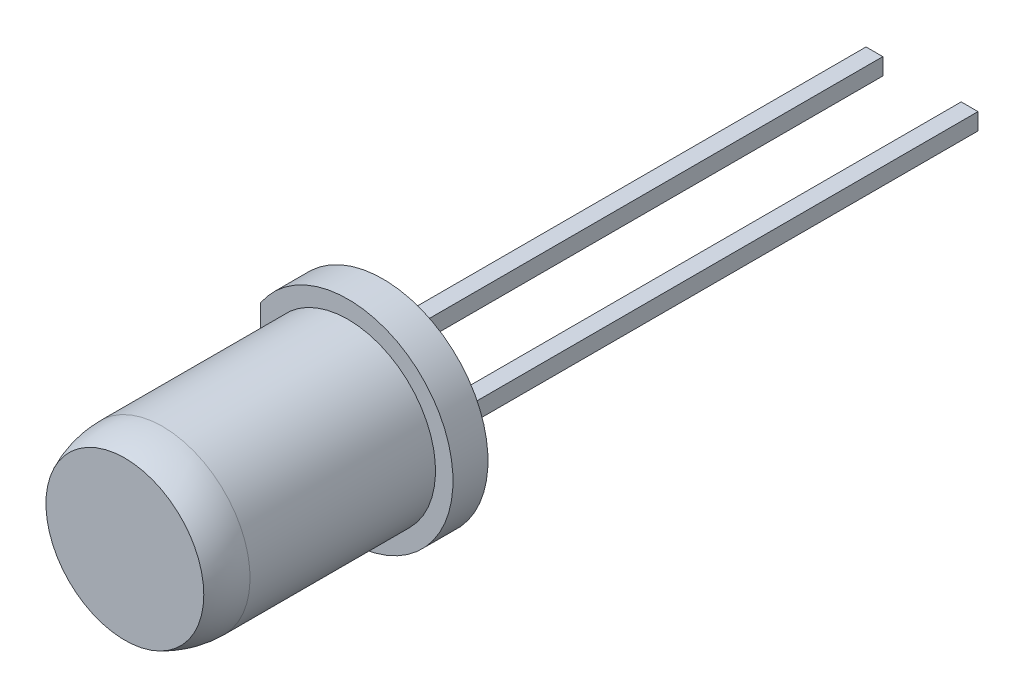
ISO-10303-21;
HEADER;
FILE_DESCRIPTION(('STEP AP214'),'2;1');
FILE_NAME('part.step','',(''),(''),'','','');
FILE_SCHEMA(('AUTOMOTIVE_DESIGN { 1 0 10303 214 1 1 1 1 }'));
ENDSEC;
DATA;
#1=APPLICATION_CONTEXT('core data for automotive mechanical design processes');
#2=APPLICATION_PROTOCOL_DEFINITION('international standard','automotive_design',2000,#1);
#3=PRODUCT_CONTEXT('',#1,'mechanical');
#4=PRODUCT('Part','Part','',(#3));
#5=PRODUCT_RELATED_PRODUCT_CATEGORY('part','',(#4));
#6=PRODUCT_DEFINITION_FORMATION('','',#4);
#7=PRODUCT_DEFINITION_CONTEXT('part definition',#1,'design');
#8=PRODUCT_DEFINITION('design','',#6,#7);
#9=PRODUCT_DEFINITION_SHAPE('','',#8);
#10=(LENGTH_UNIT() NAMED_UNIT(*) SI_UNIT(.MILLI.,.METRE.));
#11=(NAMED_UNIT(*) PLANE_ANGLE_UNIT() SI_UNIT($,.RADIAN.));
#12=(NAMED_UNIT(*) SI_UNIT($,.STERADIAN.) SOLID_ANGLE_UNIT());
#13=UNCERTAINTY_MEASURE_WITH_UNIT(LENGTH_MEASURE(1.E-05),#10,'distance_accuracy_value','');
#14=(GEOMETRIC_REPRESENTATION_CONTEXT(3) GLOBAL_UNCERTAINTY_ASSIGNED_CONTEXT((#13)) GLOBAL_UNIT_ASSIGNED_CONTEXT((#10,
#11,#12)) REPRESENTATION_CONTEXT('',''));
#15=CARTESIAN_POINT('',(0.,0.,0.));
#16=DIRECTION('',(0.,0.,1.));
#17=DIRECTION('',(1.,0.,0.));
#18=AXIS2_PLACEMENT_3D('',#15,#16,#17);
#19=CARTESIAN_POINT('',(0.,0.24,0.));
#20=DIRECTION('',(0.,1.,0.));
#21=DIRECTION('',(0.,0.,1.));
#22=AXIS2_PLACEMENT_3D('',#19,#20,#21);
#23=PLANE('',#22);
#24=DIRECTION('',(0.,0.,-1.));
#25=VECTOR('',#24,1.);
#26=CARTESIAN_POINT('',(-1.12,0.24,2.));
#27=LINE('',#26,#25);
#28=CARTESIAN_POINT('',(-1.12,0.24,2.));
#29=VERTEX_POINT('',#28);
#30=CARTESIAN_POINT('',(-1.12,0.24,-15.4043319741248));
#31=VERTEX_POINT('',#30);
#32=EDGE_CURVE('E133',#29,#31,#27,.T.);
#33=ORIENTED_EDGE('',*,*,#32,.T.);
#34=DIRECTION('',(-1.,0.,0.));
#35=VECTOR('',#34,1.);
#36=CARTESIAN_POINT('',(0.,0.24,-15.4043319741248));
#37=LINE('',#36,#35);
#38=CARTESIAN_POINT('',(-1.6,0.24,-15.4043319741248));
#39=VERTEX_POINT('',#38);
#40=EDGE_CURVE('E122',#31,#39,#37,.T.);
#41=ORIENTED_EDGE('',*,*,#40,.T.);
#42=DIRECTION('',(0.,0.,1.));
#43=VECTOR('',#42,1.);
#44=CARTESIAN_POINT('',(-1.6,0.24,0.));
#45=LINE('',#44,#43);
#46=CARTESIAN_POINT('',(-1.6,0.24,3.5));
#47=VERTEX_POINT('',#46);
#48=EDGE_CURVE('E130',#39,#47,#45,.T.);
#49=ORIENTED_EDGE('',*,*,#48,.T.);
#50=DIRECTION('',(0.514495755427526,0.,0.857492925712544));
#51=VECTOR('',#50,1.);
#52=CARTESIAN_POINT('',(-1.6,0.24,3.5));
#53=LINE('',#52,#51);
#54=CARTESIAN_POINT('',(-1.3,0.24,4.));
#55=VERTEX_POINT('',#54);
#56=EDGE_CURVE('E161',#47,#55,#53,.T.);
#57=ORIENTED_EDGE('',*,*,#56,.T.);
#58=DIRECTION('',(1.,0.,0.));
#59=VECTOR('',#58,1.);
#60=CARTESIAN_POINT('',(-1.3,0.24,4.));
#61=LINE('',#60,#59);
#62=CARTESIAN_POINT('',(-0.488634243989226,0.24,4.));
#63=VERTEX_POINT('',#62);
#64=EDGE_CURVE('E199',#55,#63,#61,.T.);
#65=ORIENTED_EDGE('',*,*,#64,.T.);
#66=CARTESIAN_POINT('',(-0.0499999999999997,0.24,4.26666666666667));
#67=DIRECTION('',(0.,1.,0.));
#68=DIRECTION('',(0.,0.,1.));
#69=AXIS2_PLACEMENT_3D('',#66,#67,#68);
#70=CIRCLE('',#69,0.513333333333333);
#71=CARTESIAN_POINT('',(0.388634243989226,0.24,4.));
#72=VERTEX_POINT('',#71);
#73=EDGE_CURVE('E151',#63,#72,#70,.F.);
#74=ORIENTED_EDGE('',*,*,#73,.T.);
#75=CARTESIAN_POINT('',(1.2,0.24,4.));
#76=VERTEX_POINT('',#75);
#77=EDGE_CURVE('E203',#72,#76,#61,.T.);
#78=ORIENTED_EDGE('',*,*,#77,.T.);
#79=DIRECTION('',(-0.508148861978286,0.,-0.861269257590315));
#80=VECTOR('',#79,1.);
#81=CARTESIAN_POINT('',(1.2,0.24,4.));
#82=LINE('',#81,#80);
#83=CARTESIAN_POINT('',(0.0199999999999998,0.24,2.));
#84=VERTEX_POINT('',#83);
#85=EDGE_CURVE('E198',#76,#84,#82,.T.);
#86=ORIENTED_EDGE('',*,*,#85,.T.);
#87=DIRECTION('',(-1.,0.,0.));
#88=VECTOR('',#87,1.);
#89=CARTESIAN_POINT('',(0.0199999999999998,0.24,2.));
#90=LINE('',#89,#88);
#91=EDGE_CURVE('E143',#84,#29,#90,.T.);
#92=ORIENTED_EDGE('',*,*,#91,.T.);
#93=EDGE_LOOP('',(#33,#41,#49,#57,#65,#74,#78,#86,#92));
#94=FACE_BOUND('',#93,.T.);
#95=ADVANCED_FACE('F52',(#94),#23,.T.);
#96=CARTESIAN_POINT('',(0.,-0.24,0.));
#97=DIRECTION('',(0.,1.,0.));
#98=DIRECTION('',(0.,0.,1.));
#99=AXIS2_PLACEMENT_3D('',#96,#97,#98);
#100=PLANE('',#99);
#101=DIRECTION('',(-1.,0.,0.));
#102=VECTOR('',#101,1.);
#103=CARTESIAN_POINT('',(0.,-0.24,-15.4043319741248));
#104=LINE('',#103,#102);
#105=CARTESIAN_POINT('',(-1.12,-0.24,-15.4043319741248));
#106=VERTEX_POINT('',#105);
#107=CARTESIAN_POINT('',(-1.6,-0.24,-15.4043319741248));
#108=VERTEX_POINT('',#107);
#109=EDGE_CURVE('E66',#106,#108,#104,.T.);
#110=ORIENTED_EDGE('',*,*,#109,.F.);
#111=DIRECTION('',(0.,0.,-1.));
#112=VECTOR('',#111,1.);
#113=CARTESIAN_POINT('',(-1.12,-0.24,2.));
#114=LINE('',#113,#112);
#115=CARTESIAN_POINT('',(-1.12,-0.24,2.));
#116=VERTEX_POINT('',#115);
#117=EDGE_CURVE('E157',#116,#106,#114,.T.);
#118=ORIENTED_EDGE('',*,*,#117,.F.);
#119=DIRECTION('',(-1.,0.,0.));
#120=VECTOR('',#119,1.);
#121=CARTESIAN_POINT('',(0.0199999999999998,-0.24,2.));
#122=LINE('',#121,#120);
#123=CARTESIAN_POINT('',(0.0199999999999998,-0.24,2.));
#124=VERTEX_POINT('',#123);
#125=EDGE_CURVE('E155',#124,#116,#122,.T.);
#126=ORIENTED_EDGE('',*,*,#125,.F.);
#127=DIRECTION('',(-0.508148861978286,0.,-0.861269257590315));
#128=VECTOR('',#127,1.);
#129=CARTESIAN_POINT('',(1.2,-0.24,4.));
#130=LINE('',#129,#128);
#131=CARTESIAN_POINT('',(1.2,-0.24,4.));
#132=VERTEX_POINT('',#131);
#133=EDGE_CURVE('E153',#132,#124,#130,.T.);
#134=ORIENTED_EDGE('',*,*,#133,.F.);
#135=DIRECTION('',(1.,0.,0.));
#136=VECTOR('',#135,1.);
#137=CARTESIAN_POINT('',(-1.3,-0.24,4.));
#138=LINE('',#137,#136);
#139=CARTESIAN_POINT('',(0.388634243989226,-0.24,4.));
#140=VERTEX_POINT('',#139);
#141=EDGE_CURVE('E150',#140,#132,#138,.T.);
#142=ORIENTED_EDGE('',*,*,#141,.F.);
#143=CARTESIAN_POINT('',(-0.0499999999999997,-0.24,4.26666666666667));
#144=DIRECTION('',(0.,1.,0.));
#145=DIRECTION('',(0.,0.,1.));
#146=AXIS2_PLACEMENT_3D('',#143,#144,#145);
#147=CIRCLE('',#146,0.513333333333333);
#148=CARTESIAN_POINT('',(-0.488634243989226,-0.24,4.));
#149=VERTEX_POINT('',#148);
#150=EDGE_CURVE('E173',#149,#140,#147,.F.);
#151=ORIENTED_EDGE('',*,*,#150,.F.);
#152=CARTESIAN_POINT('',(-1.3,-0.24,4.));
#153=VERTEX_POINT('',#152);
#154=EDGE_CURVE('E74',#153,#149,#138,.T.);
#155=ORIENTED_EDGE('',*,*,#154,.F.);
#156=DIRECTION('',(0.514495755427526,0.,0.857492925712544));
#157=VECTOR('',#156,1.);
#158=CARTESIAN_POINT('',(-1.6,-0.24,3.5));
#159=LINE('',#158,#157);
#160=CARTESIAN_POINT('',(-1.6,-0.24,3.5));
#161=VERTEX_POINT('',#160);
#162=EDGE_CURVE('E147',#161,#153,#159,.T.);
#163=ORIENTED_EDGE('',*,*,#162,.F.);
#164=DIRECTION('',(0.,0.,1.));
#165=VECTOR('',#164,1.);
#166=CARTESIAN_POINT('',(-1.6,-0.24,0.));
#167=LINE('',#166,#165);
#168=EDGE_CURVE('E160',#108,#161,#167,.T.);
#169=ORIENTED_EDGE('',*,*,#168,.F.);
#170=EDGE_LOOP('',(#110,#118,#126,#134,#142,#151,#155,#163,#169));
#171=FACE_BOUND('',#170,.T.);
#172=ADVANCED_FACE('F185',(#171),#100,.F.);
#173=CARTESIAN_POINT('',(-1.12,0.24,2.));
#174=DIRECTION('',(-1.,0.,0.));
#175=DIRECTION('',(0.,0.,1.));
#176=AXIS2_PLACEMENT_3D('',#173,#174,#175);
#177=PLANE('',#176);
#178=DIRECTION('',(0.,-1.,0.));
#179=VECTOR('',#178,1.);
#180=CARTESIAN_POINT('',(-1.12,0.24,-15.4043319741248));
#181=LINE('',#180,#179);
#182=EDGE_CURVE('E134',#31,#106,#181,.T.);
#183=ORIENTED_EDGE('',*,*,#182,.F.);
#184=ORIENTED_EDGE('',*,*,#32,.F.);
#185=DIRECTION('',(0.,-1.,0.));
#186=VECTOR('',#185,1.);
#187=CARTESIAN_POINT('',(-1.12,0.24,2.));
#188=LINE('',#187,#186);
#189=EDGE_CURVE('E141',#29,#116,#188,.T.);
#190=ORIENTED_EDGE('',*,*,#189,.T.);
#191=ORIENTED_EDGE('',*,*,#117,.T.);
#192=EDGE_LOOP('',(#183,#184,#190,#191));
#193=FACE_BOUND('',#192,.T.);
#194=ADVANCED_FACE('F214',(#193),#177,.F.);
#195=CARTESIAN_POINT('',(-1.6,0.24,0.));
#196=DIRECTION('',(1.,0.,0.));
#197=DIRECTION('',(0.,0.,-1.));
#198=AXIS2_PLACEMENT_3D('',#195,#196,#197);
#199=PLANE('',#198);
#200=DIRECTION('',(0.,1.,0.));
#201=VECTOR('',#200,1.);
#202=CARTESIAN_POINT('',(-1.6,0.24,-15.4043319741248));
#203=LINE('',#202,#201);
#204=EDGE_CURVE('E12',#108,#39,#203,.T.);
#205=ORIENTED_EDGE('',*,*,#204,.F.);
#206=ORIENTED_EDGE('',*,*,#168,.T.);
#207=DIRECTION('',(0.,-1.,0.));
#208=VECTOR('',#207,1.);
#209=CARTESIAN_POINT('',(-1.6,0.24,3.5));
#210=LINE('',#209,#208);
#211=EDGE_CURVE('E138',#47,#161,#210,.T.);
#212=ORIENTED_EDGE('',*,*,#211,.F.);
#213=ORIENTED_EDGE('',*,*,#48,.F.);
#214=EDGE_LOOP('',(#205,#206,#212,#213));
#215=FACE_BOUND('',#214,.T.);
#216=ADVANCED_FACE('F136',(#215),#199,.F.);
#217=CARTESIAN_POINT('',(-0.0499999999999997,0.,4.26666666666667));
#218=DIRECTION('',(0.,0.,1.));
#219=DIRECTION('',(-1.,0.,0.));
#220=AXIS2_PLACEMENT_3D('',#217,#218,#219);
#221=SPHERICAL_SURFACE('',#220,0.566666666666667);
#222=ORIENTED_EDGE('',*,*,#150,.T.);
#223=CARTESIAN_POINT('',(-0.0499999999999997,0.,4.));
#224=DIRECTION('',(0.,0.,1.));
#225=DIRECTION('',(1.,0.,0.));
#226=AXIS2_PLACEMENT_3D('',#223,#224,#225);
#227=CIRCLE('',#226,0.5);
#228=EDGE_CURVE('E175',#149,#140,#227,.T.);
#229=ORIENTED_EDGE('',*,*,#228,.F.);
#230=EDGE_LOOP('',(#222,#229));
#231=FACE_BOUND('',#230,.T.);
#232=ADVANCED_FACE('F183',(#231),#221,.T.);
#233=EDGE_CURVE('E60',#72,#63,#227,.T.);
#234=ORIENTED_EDGE('',*,*,#233,.F.);
#235=ORIENTED_EDGE('',*,*,#73,.F.);
#236=EDGE_LOOP('',(#234,#235));
#237=FACE_BOUND('',#236,.T.);
#238=ADVANCED_FACE('F54',(#237),#221,.T.);
#239=CARTESIAN_POINT('',(-0.55,0.,4.));
#240=DIRECTION('',(0.,0.,-1.));
#241=DIRECTION('',(-1.,0.,0.));
#242=AXIS2_PLACEMENT_3D('',#239,#240,#241);
#243=PLANE('',#242);
#244=CARTESIAN_POINT('',(-0.0499999999999997,0.,4.));
#245=DIRECTION('',(0.,0.,1.));
#246=DIRECTION('',(1.,0.,0.));
#247=AXIS2_PLACEMENT_3D('',#244,#245,#246);
#248=CIRCLE('',#247,0.2);
#249=CARTESIAN_POINT('',(0.15,0.,4.));
#250=VERTEX_POINT('',#249);
#251=EDGE_CURVE('E207',#250,#250,#248,.T.);
#252=ORIENTED_EDGE('',*,*,#251,.F.);
#253=EDGE_LOOP('',(#252));
#254=FACE_BOUND('',#253,.T.);
#255=ORIENTED_EDGE('',*,*,#233,.T.);
#256=ORIENTED_EDGE('',*,*,#64,.F.);
#257=DIRECTION('',(0.,-1.,0.));
#258=VECTOR('',#257,1.);
#259=CARTESIAN_POINT('',(-1.3,0.24,4.));
#260=LINE('',#259,#258);
#261=EDGE_CURVE('E171',#55,#153,#260,.T.);
#262=ORIENTED_EDGE('',*,*,#261,.T.);
#263=ORIENTED_EDGE('',*,*,#154,.T.);
#264=ORIENTED_EDGE('',*,*,#228,.T.);
#265=ORIENTED_EDGE('',*,*,#141,.T.);
#266=DIRECTION('',(0.,-1.,0.));
#267=VECTOR('',#266,1.);
#268=CARTESIAN_POINT('',(1.2,0.24,4.));
#269=LINE('',#268,#267);
#270=EDGE_CURVE('E168',#76,#132,#269,.T.);
#271=ORIENTED_EDGE('',*,*,#270,.F.);
#272=ORIENTED_EDGE('',*,*,#77,.F.);
#273=EDGE_LOOP('',(#255,#256,#262,#263,#264,#265,#271,#272));
#274=FACE_BOUND('',#273,.T.);
#275=ADVANCED_FACE('F180',(#254,#274),#243,.F.);
#276=CARTESIAN_POINT('',(-1.6,0.24,3.5));
#277=DIRECTION('',(0.857492925712544,0.,-0.514495755427526));
#278=DIRECTION('',(-0.514495755427526,0.,-0.857492925712544));
#279=AXIS2_PLACEMENT_3D('',#276,#277,#278);
#280=PLANE('',#279);
#281=ORIENTED_EDGE('',*,*,#162,.T.);
#282=ORIENTED_EDGE('',*,*,#261,.F.);
#283=ORIENTED_EDGE('',*,*,#56,.F.);
#284=ORIENTED_EDGE('',*,*,#211,.T.);
#285=EDGE_LOOP('',(#281,#282,#283,#284));
#286=FACE_BOUND('',#285,.T.);
#287=ADVANCED_FACE('F277',(#286),#280,.F.);
#288=CARTESIAN_POINT('',(1.2,0.24,4.));
#289=DIRECTION('',(-0.861269257590315,0.,0.508148861978286));
#290=DIRECTION('',(0.508148861978286,0.,0.861269257590315));
#291=AXIS2_PLACEMENT_3D('',#288,#289,#290);
#292=PLANE('',#291);
#293=ORIENTED_EDGE('',*,*,#133,.T.);
#294=DIRECTION('',(0.,-1.,0.));
#295=VECTOR('',#294,1.);
#296=CARTESIAN_POINT('',(0.0199999999999998,0.24,2.));
#297=LINE('',#296,#295);
#298=EDGE_CURVE('E165',#84,#124,#297,.T.);
#299=ORIENTED_EDGE('',*,*,#298,.F.);
#300=ORIENTED_EDGE('',*,*,#85,.F.);
#301=ORIENTED_EDGE('',*,*,#270,.T.);
#302=EDGE_LOOP('',(#293,#299,#300,#301));
#303=FACE_BOUND('',#302,.T.);
#304=ADVANCED_FACE('F192',(#303),#292,.F.);
#305=CARTESIAN_POINT('',(0.0199999999999998,0.24,2.));
#306=DIRECTION('',(0.,0.,1.));
#307=DIRECTION('',(1.,0.,0.));
#308=AXIS2_PLACEMENT_3D('',#305,#306,#307);
#309=PLANE('',#308);
#310=ORIENTED_EDGE('',*,*,#125,.T.);
#311=ORIENTED_EDGE('',*,*,#189,.F.);
#312=ORIENTED_EDGE('',*,*,#91,.F.);
#313=ORIENTED_EDGE('',*,*,#298,.T.);
#314=EDGE_LOOP('',(#310,#311,#312,#313));
#315=FACE_BOUND('',#314,.T.);
#316=ADVANCED_FACE('F196',(#315),#309,.F.);
#317=CARTESIAN_POINT('',(-0.0499999999999997,0.,3.9));
#318=DIRECTION('',(0.,0.,1.));
#319=DIRECTION('',(1.,0.,0.));
#320=AXIS2_PLACEMENT_3D('',#317,#318,#319);
#321=CYLINDRICAL_SURFACE('',#320,0.2);
#322=CARTESIAN_POINT('',(-0.0499999999999997,0.,3.9));
#323=DIRECTION('',(0.,0.,1.));
#324=DIRECTION('',(1.,0.,0.));
#325=AXIS2_PLACEMENT_3D('',#322,#323,#324);
#326=CIRCLE('',#325,0.2);
#327=CARTESIAN_POINT('',(0.15,0.,3.9));
#328=VERTEX_POINT('',#327);
#329=EDGE_CURVE('E206',#328,#328,#326,.T.);
#330=ORIENTED_EDGE('',*,*,#329,.F.);
#331=EDGE_LOOP('',(#330));
#332=FACE_BOUND('',#331,.T.);
#333=ORIENTED_EDGE('',*,*,#251,.T.);
#334=EDGE_LOOP('',(#333));
#335=FACE_BOUND('',#334,.T.);
#336=ADVANCED_FACE('F230',(#332,#335),#321,.F.);
#337=CARTESIAN_POINT('',(-0.0499999999999997,0.,3.9));
#338=DIRECTION('',(0.,0.,1.));
#339=DIRECTION('',(1.,0.,0.));
#340=AXIS2_PLACEMENT_3D('',#337,#338,#339);
#341=PLANE('',#340);
#342=ORIENTED_EDGE('',*,*,#329,.T.);
#343=EDGE_LOOP('',(#342));
#344=FACE_BOUND('',#343,.T.);
#345=ADVANCED_FACE('F233',(#344),#341,.T.);
#346=CARTESIAN_POINT('',(-10.9818245663984,-3.,-15.4043319741248));
#347=DIRECTION('',(0.,0.,-1.));
#348=DIRECTION('',(-1.,0.,0.));
#349=AXIS2_PLACEMENT_3D('',#346,#347,#348);
#350=PLANE('',#349);
#351=ORIENTED_EDGE('',*,*,#182,.T.);
#352=ORIENTED_EDGE('',*,*,#109,.T.);
#353=ORIENTED_EDGE('',*,*,#204,.T.);
#354=ORIENTED_EDGE('',*,*,#40,.F.);
#355=EDGE_LOOP('',(#351,#352,#353,#354));
#356=FACE_BOUND('',#355,.T.);
#357=ADVANCED_FACE('F121',(#356),#350,.T.);
#358=CLOSED_SHELL('',(#95,#172,#194,#216,#232,#238,#275,#287,#304,#316,#336,#345,#357));
#359=MANIFOLD_SOLID_BREP('B2',#358);
#360=CARTESIAN_POINT('',(1.6,0.24,4.));
#361=DIRECTION('',(-1.,0.,0.));
#362=DIRECTION('',(0.,0.,1.));
#363=AXIS2_PLACEMENT_3D('',#360,#361,#362);
#364=PLANE('',#363);
#365=DIRECTION('',(0.,-1.,0.));
#366=VECTOR('',#365,1.);
#367=CARTESIAN_POINT('',(1.6,0.24,-15.4043319741248));
#368=LINE('',#367,#366);
#369=CARTESIAN_POINT('',(1.6,0.24,-15.4043319741248));
#370=VERTEX_POINT('',#369);
#371=CARTESIAN_POINT('',(1.6,-0.24,-15.4043319741248));
#372=VERTEX_POINT('',#371);
#373=EDGE_CURVE('E384',#370,#372,#368,.T.);
#374=ORIENTED_EDGE('',*,*,#373,.F.);
#375=DIRECTION('',(0.,0.,-1.));
#376=VECTOR('',#375,1.);
#377=CARTESIAN_POINT('',(1.6,0.24,4.));
#378=LINE('',#377,#376);
#379=CARTESIAN_POINT('',(1.6,0.24,4.));
#380=VERTEX_POINT('',#379);
#381=EDGE_CURVE('E474',#380,#370,#378,.T.);
#382=ORIENTED_EDGE('',*,*,#381,.F.);
#383=DIRECTION('',(0.,-1.,0.));
#384=VECTOR('',#383,1.);
#385=CARTESIAN_POINT('',(1.6,0.24,4.));
#386=LINE('',#385,#384);
#387=CARTESIAN_POINT('',(1.6,-0.24,4.));
#388=VERTEX_POINT('',#387);
#389=EDGE_CURVE('E450',#380,#388,#386,.T.);
#390=ORIENTED_EDGE('',*,*,#389,.T.);
#391=DIRECTION('',(0.,0.,-1.));
#392=VECTOR('',#391,1.);
#393=CARTESIAN_POINT('',(1.6,-0.24,4.));
#394=LINE('',#393,#392);
#395=EDGE_CURVE('E441',#388,#372,#394,.T.);
#396=ORIENTED_EDGE('',*,*,#395,.T.);
#397=EDGE_LOOP('',(#374,#382,#390,#396));
#398=FACE_BOUND('',#397,.T.);
#399=ADVANCED_FACE('F369',(#398),#364,.F.);
#400=CARTESIAN_POINT('',(1.12,0.24,0.));
#401=DIRECTION('',(1.,0.,0.));
#402=DIRECTION('',(0.,0.,-1.));
#403=AXIS2_PLACEMENT_3D('',#400,#401,#402);
#404=PLANE('',#403);
#405=DIRECTION('',(0.,1.,0.));
#406=VECTOR('',#405,1.);
#407=CARTESIAN_POINT('',(1.12,0.24,-15.4043319741248));
#408=LINE('',#407,#406);
#409=CARTESIAN_POINT('',(1.12,-0.24,-15.4043319741248));
#410=VERTEX_POINT('',#409);
#411=CARTESIAN_POINT('',(1.12,0.24,-15.4043319741248));
#412=VERTEX_POINT('',#411);
#413=EDGE_CURVE('E430',#410,#412,#408,.T.);
#414=ORIENTED_EDGE('',*,*,#413,.F.);
#415=DIRECTION('',(0.,0.,1.));
#416=VECTOR('',#415,1.);
#417=CARTESIAN_POINT('',(1.12,-0.24,0.));
#418=LINE('',#417,#416);
#419=CARTESIAN_POINT('',(1.12,-0.24,2.));
#420=VERTEX_POINT('',#419);
#421=EDGE_CURVE('E414',#410,#420,#418,.T.);
#422=ORIENTED_EDGE('',*,*,#421,.T.);
#423=DIRECTION('',(0.,-1.,0.));
#424=VECTOR('',#423,1.);
#425=CARTESIAN_POINT('',(1.12,0.24,2.));
#426=LINE('',#425,#424);
#427=CARTESIAN_POINT('',(1.12,0.24,2.));
#428=VERTEX_POINT('',#427);
#429=EDGE_CURVE('E448',#428,#420,#426,.T.);
#430=ORIENTED_EDGE('',*,*,#429,.F.);
#431=DIRECTION('',(0.,0.,1.));
#432=VECTOR('',#431,1.);
#433=CARTESIAN_POINT('',(1.12,0.24,0.));
#434=LINE('',#433,#432);
#435=EDGE_CURVE('E392',#412,#428,#434,.T.);
#436=ORIENTED_EDGE('',*,*,#435,.F.);
#437=EDGE_LOOP('',(#414,#422,#430,#436));
#438=FACE_BOUND('',#437,.T.);
#439=ADVANCED_FACE('F434',(#438),#404,.F.);
#440=CARTESIAN_POINT('',(0.,0.24,0.));
#441=DIRECTION('',(0.,-1.,0.));
#442=DIRECTION('',(0.,0.,-1.));
#443=AXIS2_PLACEMENT_3D('',#440,#441,#442);
#444=PLANE('',#443);
#445=DIRECTION('',(1.,0.,0.));
#446=VECTOR('',#445,1.);
#447=CARTESIAN_POINT('',(0.,0.24,-15.4043319741248));
#448=LINE('',#447,#446);
#449=EDGE_CURVE('E460',#412,#370,#448,.T.);
#450=ORIENTED_EDGE('',*,*,#449,.F.);
#451=ORIENTED_EDGE('',*,*,#435,.T.);
#452=DIRECTION('',(-1.,0.,0.));
#453=VECTOR('',#452,1.);
#454=CARTESIAN_POINT('',(1.12,0.24,2.));
#455=LINE('',#454,#453);
#456=CARTESIAN_POINT('',(0.22,0.24,2.));
#457=VERTEX_POINT('',#456);
#458=EDGE_CURVE('E440',#428,#457,#455,.T.);
#459=ORIENTED_EDGE('',*,*,#458,.T.);
#460=DIRECTION('',(0.508148861978286,0.,0.861269257590315));
#461=VECTOR('',#460,1.);
#462=CARTESIAN_POINT('',(0.22,0.24,2.));
#463=LINE('',#462,#461);
#464=CARTESIAN_POINT('',(1.4,0.24,4.));
#465=VERTEX_POINT('',#464);
#466=EDGE_CURVE('E422',#457,#465,#463,.T.);
#467=ORIENTED_EDGE('',*,*,#466,.T.);
#468=DIRECTION('',(1.,0.,0.));
#469=VECTOR('',#468,1.);
#470=CARTESIAN_POINT('',(1.4,0.24,4.));
#471=LINE('',#470,#469);
#472=EDGE_CURVE('E475',#465,#380,#471,.T.);
#473=ORIENTED_EDGE('',*,*,#472,.T.);
#474=ORIENTED_EDGE('',*,*,#381,.T.);
#475=EDGE_LOOP('',(#450,#451,#459,#467,#473,#474));
#476=FACE_BOUND('',#475,.T.);
#477=ADVANCED_FACE('F479',(#476),#444,.F.);
#478=CARTESIAN_POINT('',(0.,-0.24,0.));
#479=DIRECTION('',(0.,-1.,0.));
#480=DIRECTION('',(0.,0.,-1.));
#481=AXIS2_PLACEMENT_3D('',#478,#479,#480);
#482=PLANE('',#481);
#483=ORIENTED_EDGE('',*,*,#421,.F.);
#484=DIRECTION('',(1.,0.,0.));
#485=VECTOR('',#484,1.);
#486=CARTESIAN_POINT('',(0.,-0.24,-15.4043319741248));
#487=LINE('',#486,#485);
#488=EDGE_CURVE('E50',#410,#372,#487,.T.);
#489=ORIENTED_EDGE('',*,*,#488,.T.);
#490=ORIENTED_EDGE('',*,*,#395,.F.);
#491=DIRECTION('',(1.,0.,0.));
#492=VECTOR('',#491,1.);
#493=CARTESIAN_POINT('',(1.4,-0.24,4.));
#494=LINE('',#493,#492);
#495=CARTESIAN_POINT('',(1.4,-0.24,4.));
#496=VERTEX_POINT('',#495);
#497=EDGE_CURVE('E444',#496,#388,#494,.T.);
#498=ORIENTED_EDGE('',*,*,#497,.F.);
#499=DIRECTION('',(0.508148861978286,0.,0.861269257590315));
#500=VECTOR('',#499,1.);
#501=CARTESIAN_POINT('',(0.22,-0.24,2.));
#502=LINE('',#501,#500);
#503=CARTESIAN_POINT('',(0.22,-0.24,2.));
#504=VERTEX_POINT('',#503);
#505=EDGE_CURVE('E457',#504,#496,#502,.T.);
#506=ORIENTED_EDGE('',*,*,#505,.F.);
#507=DIRECTION('',(-1.,0.,0.));
#508=VECTOR('',#507,1.);
#509=CARTESIAN_POINT('',(1.12,-0.24,2.));
#510=LINE('',#509,#508);
#511=EDGE_CURVE('E439',#420,#504,#510,.T.);
#512=ORIENTED_EDGE('',*,*,#511,.F.);
#513=EDGE_LOOP('',(#483,#489,#490,#498,#506,#512));
#514=FACE_BOUND('',#513,.T.);
#515=ADVANCED_FACE('F437',(#514),#482,.T.);
#516=CARTESIAN_POINT('',(1.12,0.24,2.));
#517=DIRECTION('',(0.,0.,1.));
#518=DIRECTION('',(1.,0.,0.));
#519=AXIS2_PLACEMENT_3D('',#516,#517,#518);
#520=PLANE('',#519);
#521=ORIENTED_EDGE('',*,*,#511,.T.);
#522=DIRECTION('',(0.,-1.,0.));
#523=VECTOR('',#522,1.);
#524=CARTESIAN_POINT('',(0.22,0.24,2.));
#525=LINE('',#524,#523);
#526=EDGE_CURVE('E377',#457,#504,#525,.T.);
#527=ORIENTED_EDGE('',*,*,#526,.F.);
#528=ORIENTED_EDGE('',*,*,#458,.F.);
#529=ORIENTED_EDGE('',*,*,#429,.T.);
#530=EDGE_LOOP('',(#521,#527,#528,#529));
#531=FACE_BOUND('',#530,.T.);
#532=ADVANCED_FACE('F371',(#531),#520,.F.);
#533=CARTESIAN_POINT('',(0.22,0.24,2.));
#534=DIRECTION('',(0.861269257590315,0.,-0.508148861978286));
#535=DIRECTION('',(-0.508148861978286,0.,-0.861269257590315));
#536=AXIS2_PLACEMENT_3D('',#533,#534,#535);
#537=PLANE('',#536);
#538=ORIENTED_EDGE('',*,*,#505,.T.);
#539=DIRECTION('',(0.,-1.,0.));
#540=VECTOR('',#539,1.);
#541=CARTESIAN_POINT('',(1.4,0.24,4.));
#542=LINE('',#541,#540);
#543=EDGE_CURVE('E453',#465,#496,#542,.T.);
#544=ORIENTED_EDGE('',*,*,#543,.F.);
#545=ORIENTED_EDGE('',*,*,#466,.F.);
#546=ORIENTED_EDGE('',*,*,#526,.T.);
#547=EDGE_LOOP('',(#538,#544,#545,#546));
#548=FACE_BOUND('',#547,.T.);
#549=ADVANCED_FACE('F456',(#548),#537,.F.);
#550=CARTESIAN_POINT('',(1.4,0.24,4.));
#551=DIRECTION('',(0.,0.,-1.));
#552=DIRECTION('',(-1.,0.,0.));
#553=AXIS2_PLACEMENT_3D('',#550,#551,#552);
#554=PLANE('',#553);
#555=ORIENTED_EDGE('',*,*,#497,.T.);
#556=ORIENTED_EDGE('',*,*,#389,.F.);
#557=ORIENTED_EDGE('',*,*,#472,.F.);
#558=ORIENTED_EDGE('',*,*,#543,.T.);
#559=EDGE_LOOP('',(#555,#556,#557,#558));
#560=FACE_BOUND('',#559,.T.);
#561=ADVANCED_FACE('F469',(#560),#554,.F.);
#562=CARTESIAN_POINT('',(-10.9818245663984,-3.,-15.4043319741248));
#563=DIRECTION('',(0.,0.,-1.));
#564=DIRECTION('',(-1.,0.,0.));
#565=AXIS2_PLACEMENT_3D('',#562,#563,#564);
#566=PLANE('',#565);
#567=ORIENTED_EDGE('',*,*,#449,.T.);
#568=ORIENTED_EDGE('',*,*,#373,.T.);
#569=ORIENTED_EDGE('',*,*,#488,.F.);
#570=ORIENTED_EDGE('',*,*,#413,.T.);
#571=EDGE_LOOP('',(#567,#568,#569,#570));
#572=FACE_BOUND('',#571,.T.);
#573=ADVANCED_FACE('F429',(#572),#566,.T.);
#574=CLOSED_SHELL('',(#399,#439,#477,#515,#532,#549,#561,#573));
#575=MANIFOLD_SOLID_BREP('B6',#574);
#576=CARTESIAN_POINT('',(0.,0.,6.3));
#577=DIRECTION('',(0.,0.,-1.));
#578=DIRECTION('',(0.,1.,0.));
#579=AXIS2_PLACEMENT_3D('',#576,#577,#578);
#580=SPHERICAL_SURFACE('',#579,2.5);
#581=CARTESIAN_POINT('',(0.,0.,6.3));
#582=DIRECTION('',(0.,0.,-1.));
#583=DIRECTION('',(0.,1.,0.));
#584=AXIS2_PLACEMENT_3D('',#581,#582,#583);
#585=CIRCLE('',#584,2.5);
#586=CARTESIAN_POINT('',(0.,2.5,6.3));
#587=VERTEX_POINT('',#586);
#588=EDGE_CURVE('E776',#587,#587,#585,.T.);
#589=ORIENTED_EDGE('',*,*,#588,.F.);
#590=EDGE_LOOP('',(#589));
#591=FACE_BOUND('',#590,.T.);
#592=CARTESIAN_POINT('',(0.,0.,7.37789973069169));
#593=DIRECTION('',(0.,0.,1.));
#594=DIRECTION('',(1.,0.,0.));
#595=AXIS2_PLACEMENT_3D('',#592,#593,#594);
#596=CIRCLE('',#595,2.25568884613432);
#597=CARTESIAN_POINT('',(2.25568884613432,0.,7.37789973069169));
#598=VERTEX_POINT('',#597);
#599=EDGE_CURVE('E576',#598,#598,#596,.F.);
#600=ORIENTED_EDGE('',*,*,#599,.T.);
#601=EDGE_LOOP('',(#600));
#602=FACE_BOUND('',#601,.T.);
#603=ADVANCED_FACE('F572',(#591,#602),#580,.T.);
#604=CARTESIAN_POINT('',(0.,0.,1.));
#605=DIRECTION('',(0.,0.,-1.));
#606=DIRECTION('',(-1.,0.,0.));
#607=AXIS2_PLACEMENT_3D('',#604,#605,#606);
#608=CYLINDRICAL_SURFACE('',#607,3.);
#609=CARTESIAN_POINT('',(0.,0.,1.));
#610=DIRECTION('',(0.,0.,1.));
#611=DIRECTION('',(1.,0.,0.));
#612=AXIS2_PLACEMENT_3D('',#609,#610,#611);
#613=CIRCLE('',#612,3.);
#614=CARTESIAN_POINT('',(-2.5,-1.6583123951777,1.));
#615=VERTEX_POINT('',#614);
#616=CARTESIAN_POINT('',(-2.5,1.6583123951777,1.));
#617=VERTEX_POINT('',#616);
#618=EDGE_CURVE('E581',#615,#617,#613,.T.);
#619=ORIENTED_EDGE('',*,*,#618,.F.);
#620=DIRECTION('',(0.,0.,-1.));
#621=VECTOR('',#620,1.);
#622=CARTESIAN_POINT('',(-2.5,-1.6583123951777,4.35410196624969));
#623=LINE('',#622,#621);
#624=CARTESIAN_POINT('',(-2.5,-1.6583123951777,0.));
#625=VERTEX_POINT('',#624);
#626=EDGE_CURVE('E771',#615,#625,#623,.T.);
#627=ORIENTED_EDGE('',*,*,#626,.T.);
#628=CARTESIAN_POINT('',(0.,0.,0.));
#629=DIRECTION('',(0.,0.,1.));
#630=DIRECTION('',(1.,0.,0.));
#631=AXIS2_PLACEMENT_3D('',#628,#629,#630);
#632=CIRCLE('',#631,3.);
#633=CARTESIAN_POINT('',(-2.5,1.6583123951777,0.));
#634=VERTEX_POINT('',#633);
#635=EDGE_CURVE('E779',#625,#634,#632,.T.);
#636=ORIENTED_EDGE('',*,*,#635,.T.);
#637=DIRECTION('',(0.,0.,-1.));
#638=VECTOR('',#637,1.);
#639=CARTESIAN_POINT('',(-2.5,1.6583123951777,4.35410196624969));
#640=LINE('',#639,#638);
#641=EDGE_CURVE('E774',#617,#634,#640,.T.);
#642=ORIENTED_EDGE('',*,*,#641,.F.);
#643=EDGE_LOOP('',(#619,#627,#636,#642));
#644=FACE_BOUND('',#643,.T.);
#645=ADVANCED_FACE('F574',(#644),#608,.T.);
#646=CARTESIAN_POINT('',(0.,0.,1.));
#647=DIRECTION('',(0.,0.,1.));
#648=DIRECTION('',(1.,0.,0.));
#649=AXIS2_PLACEMENT_3D('',#646,#647,#648);
#650=PLANE('',#649);
#651=DIRECTION('',(0.,-1.,0.));
#652=VECTOR('',#651,1.);
#653=CARTESIAN_POINT('',(-2.5,1.6583123951777,1.));
#654=LINE('',#653,#652);
#655=CARTESIAN_POINT('',(-2.5,0.,1.));
#656=VERTEX_POINT('',#655);
#657=EDGE_CURVE('E766',#656,#615,#654,.T.);
#658=ORIENTED_EDGE('',*,*,#657,.T.);
#659=ORIENTED_EDGE('',*,*,#618,.T.);
#660=EDGE_CURVE('E768',#617,#656,#654,.T.);
#661=ORIENTED_EDGE('',*,*,#660,.T.);
#662=CARTESIAN_POINT('',(0.,0.,1.));
#663=DIRECTION('',(0.,0.,1.));
#664=DIRECTION('',(1.,0.,0.));
#665=AXIS2_PLACEMENT_3D('',#662,#663,#664);
#666=CIRCLE('',#665,2.5);
#667=EDGE_CURVE('E367',#656,#656,#666,.T.);
#668=ORIENTED_EDGE('',*,*,#667,.F.);
#669=EDGE_LOOP('',(#658,#659,#661,#668));
#670=FACE_BOUND('',#669,.T.);
#671=ADVANCED_FACE('F794',(#670),#650,.T.);
#672=CARTESIAN_POINT('',(0.,0.,0.));
#673=DIRECTION('',(0.,0.,1.));
#674=DIRECTION('',(1.,0.,0.));
#675=AXIS2_PLACEMENT_3D('',#672,#673,#674);
#676=PLANE('',#675);
#677=DIRECTION('',(0.,1.,0.));
#678=VECTOR('',#677,1.);
#679=CARTESIAN_POINT('',(-1.6,-0.24,0.));
#680=LINE('',#679,#678);
#681=CARTESIAN_POINT('',(-1.6,-0.24,0.));
#682=VERTEX_POINT('',#681);
#683=CARTESIAN_POINT('',(-1.6,0.24,0.));
#684=VERTEX_POINT('',#683);
#685=EDGE_CURVE('E688',#682,#684,#680,.T.);
#686=ORIENTED_EDGE('',*,*,#685,.F.);
#687=DIRECTION('',(-1.,0.,0.));
#688=VECTOR('',#687,1.);
#689=CARTESIAN_POINT('',(-1.6,-0.24,0.));
#690=LINE('',#689,#688);
#691=CARTESIAN_POINT('',(-1.12,-0.24,0.));
#692=VERTEX_POINT('',#691);
#693=EDGE_CURVE('E695',#692,#682,#690,.T.);
#694=ORIENTED_EDGE('',*,*,#693,.F.);
#695=DIRECTION('',(0.,1.,0.));
#696=VECTOR('',#695,1.);
#697=CARTESIAN_POINT('',(-1.12,-0.24,0.));
#698=LINE('',#697,#696);
#699=CARTESIAN_POINT('',(-1.12,0.24,0.));
#700=VERTEX_POINT('',#699);
#701=EDGE_CURVE('E767',#692,#700,#698,.T.);
#702=ORIENTED_EDGE('',*,*,#701,.T.);
#703=DIRECTION('',(-1.,0.,0.));
#704=VECTOR('',#703,1.);
#705=CARTESIAN_POINT('',(-1.6,0.24,0.));
#706=LINE('',#705,#704);
#707=EDGE_CURVE('E709',#700,#684,#706,.T.);
#708=ORIENTED_EDGE('',*,*,#707,.T.);
#709=EDGE_LOOP('',(#686,#694,#702,#708));
#710=FACE_BOUND('',#709,.T.);
#711=DIRECTION('',(0.,1.,0.));
#712=VECTOR('',#711,1.);
#713=CARTESIAN_POINT('',(1.12,-0.24,0.));
#714=LINE('',#713,#712);
#715=CARTESIAN_POINT('',(1.12,-0.24,0.));
#716=VERTEX_POINT('',#715);
#717=CARTESIAN_POINT('',(1.12,0.24,0.));
#718=VERTEX_POINT('',#717);
#719=EDGE_CURVE('E736',#716,#718,#714,.T.);
#720=ORIENTED_EDGE('',*,*,#719,.F.);
#721=DIRECTION('',(-1.,0.,0.));
#722=VECTOR('',#721,1.);
#723=CARTESIAN_POINT('',(1.12,-0.24,0.));
#724=LINE('',#723,#722);
#725=CARTESIAN_POINT('',(1.6,-0.24,0.));
#726=VERTEX_POINT('',#725);
#727=EDGE_CURVE('E717',#726,#716,#724,.T.);
#728=ORIENTED_EDGE('',*,*,#727,.F.);
#729=DIRECTION('',(0.,1.,0.));
#730=VECTOR('',#729,1.);
#731=CARTESIAN_POINT('',(1.6,-0.24,0.));
#732=LINE('',#731,#730);
#733=CARTESIAN_POINT('',(1.6,0.24,0.));
#734=VERTEX_POINT('',#733);
#735=EDGE_CURVE('E752',#726,#734,#732,.T.);
#736=ORIENTED_EDGE('',*,*,#735,.T.);
#737=DIRECTION('',(-1.,0.,0.));
#738=VECTOR('',#737,1.);
#739=CARTESIAN_POINT('',(1.12,0.24,0.));
#740=LINE('',#739,#738);
#741=EDGE_CURVE('E737',#734,#718,#740,.T.);
#742=ORIENTED_EDGE('',*,*,#741,.T.);
#743=EDGE_LOOP('',(#720,#728,#736,#742));
#744=FACE_BOUND('',#743,.T.);
#745=ORIENTED_EDGE('',*,*,#635,.F.);
#746=DIRECTION('',(0.,-1.,0.));
#747=VECTOR('',#746,1.);
#748=CARTESIAN_POINT('',(-2.5,1.6583123951777,0.));
#749=LINE('',#748,#747);
#750=EDGE_CURVE('E764',#634,#625,#749,.T.);
#751=ORIENTED_EDGE('',*,*,#750,.F.);
#752=EDGE_LOOP('',(#745,#751));
#753=FACE_BOUND('',#752,.T.);
#754=ADVANCED_FACE('F707',(#710,#744,#753),#676,.F.);
#755=CARTESIAN_POINT('',(0.,0.,1.));
#756=DIRECTION('',(0.,0.,-1.));
#757=DIRECTION('',(0.,1.,0.));
#758=AXIS2_PLACEMENT_3D('',#755,#756,#757);
#759=CYLINDRICAL_SURFACE('',#758,2.5);
#760=ORIENTED_EDGE('',*,*,#588,.T.);
#761=EDGE_LOOP('',(#760));
#762=FACE_BOUND('',#761,.T.);
#763=ORIENTED_EDGE('',*,*,#667,.T.);
#764=EDGE_LOOP('',(#763));
#765=FACE_BOUND('',#764,.T.);
#766=ADVANCED_FACE('F796',(#762,#765),#759,.T.);
#767=CARTESIAN_POINT('',(-2.5,1.6583123951777,4.35410196624969));
#768=DIRECTION('',(1.,0.,0.));
#769=DIRECTION('',(0.,0.,-1.));
#770=AXIS2_PLACEMENT_3D('',#767,#768,#769);
#771=PLANE('',#770);
#772=ORIENTED_EDGE('',*,*,#641,.T.);
#773=ORIENTED_EDGE('',*,*,#750,.T.);
#774=ORIENTED_EDGE('',*,*,#626,.F.);
#775=ORIENTED_EDGE('',*,*,#657,.F.);
#776=ORIENTED_EDGE('',*,*,#660,.F.);
#777=EDGE_LOOP('',(#772,#773,#774,#775,#776));
#778=FACE_BOUND('',#777,.T.);
#779=ADVANCED_FACE('F790',(#778),#771,.F.);
#780=CARTESIAN_POINT('',(1.6,-0.24,0.));
#781=DIRECTION('',(1.,0.,0.));
#782=DIRECTION('',(0.,0.,-1.));
#783=AXIS2_PLACEMENT_3D('',#780,#781,#782);
#784=PLANE('',#783);
#785=DIRECTION('',(0.,0.,-1.));
#786=VECTOR('',#785,1.);
#787=CARTESIAN_POINT('',(1.6,0.24,0.));
#788=LINE('',#787,#786);
#789=CARTESIAN_POINT('',(1.6,0.24,4.));
#790=VERTEX_POINT('',#789);
#791=EDGE_CURVE('E721',#790,#734,#788,.T.);
#792=ORIENTED_EDGE('',*,*,#791,.T.);
#793=ORIENTED_EDGE('',*,*,#735,.F.);
#794=DIRECTION('',(0.,0.,-1.));
#795=VECTOR('',#794,1.);
#796=CARTESIAN_POINT('',(1.6,-0.24,0.));
#797=LINE('',#796,#795);
#798=CARTESIAN_POINT('',(1.6,-0.24,4.));
#799=VERTEX_POINT('',#798);
#800=EDGE_CURVE('E733',#799,#726,#797,.T.);
#801=ORIENTED_EDGE('',*,*,#800,.F.);
#802=DIRECTION('',(0.,1.,0.));
#803=VECTOR('',#802,1.);
#804=CARTESIAN_POINT('',(1.6,-0.24,4.));
#805=LINE('',#804,#803);
#806=EDGE_CURVE('E755',#799,#790,#805,.T.);
#807=ORIENTED_EDGE('',*,*,#806,.T.);
#808=EDGE_LOOP('',(#792,#793,#801,#807));
#809=FACE_BOUND('',#808,.T.);
#810=ADVANCED_FACE('F804',(#809),#784,.F.);
#811=CARTESIAN_POINT('',(1.6,-0.24,4.));
#812=DIRECTION('',(0.,0.,1.));
#813=DIRECTION('',(1.,0.,0.));
#814=AXIS2_PLACEMENT_3D('',#811,#812,#813);
#815=PLANE('',#814);
#816=DIRECTION('',(1.,0.,0.));
#817=VECTOR('',#816,1.);
#818=CARTESIAN_POINT('',(1.6,0.24,4.));
#819=LINE('',#818,#817);
#820=CARTESIAN_POINT('',(1.4,0.24,4.));
#821=VERTEX_POINT('',#820);
#822=EDGE_CURVE('E747',#821,#790,#819,.T.);
#823=ORIENTED_EDGE('',*,*,#822,.T.);
#824=ORIENTED_EDGE('',*,*,#806,.F.);
#825=DIRECTION('',(1.,0.,0.));
#826=VECTOR('',#825,1.);
#827=CARTESIAN_POINT('',(1.6,-0.24,4.));
#828=LINE('',#827,#826);
#829=CARTESIAN_POINT('',(1.4,-0.24,4.));
#830=VERTEX_POINT('',#829);
#831=EDGE_CURVE('E730',#830,#799,#828,.T.);
#832=ORIENTED_EDGE('',*,*,#831,.F.);
#833=DIRECTION('',(0.,1.,0.));
#834=VECTOR('',#833,1.);
#835=CARTESIAN_POINT('',(1.4,-0.24,4.));
#836=LINE('',#835,#834);
#837=EDGE_CURVE('E757',#830,#821,#836,.T.);
#838=ORIENTED_EDGE('',*,*,#837,.T.);
#839=EDGE_LOOP('',(#823,#824,#832,#838));
#840=FACE_BOUND('',#839,.T.);
#841=ADVANCED_FACE('F839',(#840),#815,.F.);
#842=CARTESIAN_POINT('',(1.4,-0.24,4.));
#843=DIRECTION('',(-0.861269257590315,0.,0.508148861978286));
#844=DIRECTION('',(0.508148861978286,0.,0.861269257590315));
#845=AXIS2_PLACEMENT_3D('',#842,#843,#844);
#846=PLANE('',#845);
#847=DIRECTION('',(0.508148861978286,0.,0.861269257590315));
#848=VECTOR('',#847,1.);
#849=CARTESIAN_POINT('',(1.4,0.24,4.));
#850=LINE('',#849,#848);
#851=CARTESIAN_POINT('',(0.22,0.24,2.));
#852=VERTEX_POINT('',#851);
#853=EDGE_CURVE('E744',#852,#821,#850,.T.);
#854=ORIENTED_EDGE('',*,*,#853,.T.);
#855=ORIENTED_EDGE('',*,*,#837,.F.);
#856=DIRECTION('',(0.508148861978286,0.,0.861269257590315));
#857=VECTOR('',#856,1.);
#858=CARTESIAN_POINT('',(1.4,-0.24,4.));
#859=LINE('',#858,#857);
#860=CARTESIAN_POINT('',(0.22,-0.24,2.));
#861=VERTEX_POINT('',#860);
#862=EDGE_CURVE('E727',#861,#830,#859,.T.);
#863=ORIENTED_EDGE('',*,*,#862,.F.);
#864=DIRECTION('',(0.,1.,0.));
#865=VECTOR('',#864,1.);
#866=CARTESIAN_POINT('',(0.22,-0.24,2.));
#867=LINE('',#866,#865);
#868=EDGE_CURVE('E759',#861,#852,#867,.T.);
#869=ORIENTED_EDGE('',*,*,#868,.T.);
#870=EDGE_LOOP('',(#854,#855,#863,#869));
#871=FACE_BOUND('',#870,.T.);
#872=ADVANCED_FACE('F849',(#871),#846,.F.);
#873=CARTESIAN_POINT('',(0.22,-0.24,2.));
#874=DIRECTION('',(0.,0.,-1.));
#875=DIRECTION('',(-1.,0.,0.));
#876=AXIS2_PLACEMENT_3D('',#873,#874,#875);
#877=PLANE('',#876);
#878=DIRECTION('',(-1.,0.,0.));
#879=VECTOR('',#878,1.);
#880=CARTESIAN_POINT('',(0.22,0.24,2.));
#881=LINE('',#880,#879);
#882=CARTESIAN_POINT('',(1.12,0.24,2.));
#883=VERTEX_POINT('',#882);
#884=EDGE_CURVE('E741',#883,#852,#881,.T.);
#885=ORIENTED_EDGE('',*,*,#884,.T.);
#886=ORIENTED_EDGE('',*,*,#868,.F.);
#887=DIRECTION('',(-1.,0.,0.));
#888=VECTOR('',#887,1.);
#889=CARTESIAN_POINT('',(0.22,-0.24,2.));
#890=LINE('',#889,#888);
#891=CARTESIAN_POINT('',(1.12,-0.24,2.));
#892=VERTEX_POINT('',#891);
#893=EDGE_CURVE('E724',#892,#861,#890,.T.);
#894=ORIENTED_EDGE('',*,*,#893,.F.);
#895=DIRECTION('',(0.,1.,0.));
#896=VECTOR('',#895,1.);
#897=CARTESIAN_POINT('',(1.12,-0.24,2.));
#898=LINE('',#897,#896);
#899=EDGE_CURVE('E761',#892,#883,#898,.T.);
#900=ORIENTED_EDGE('',*,*,#899,.T.);
#901=EDGE_LOOP('',(#885,#886,#894,#900));
#902=FACE_BOUND('',#901,.T.);
#903=ADVANCED_FACE('F859',(#902),#877,.F.);
#904=CARTESIAN_POINT('',(1.12,-0.24,2.));
#905=DIRECTION('',(-1.,0.,0.));
#906=DIRECTION('',(0.,0.,1.));
#907=AXIS2_PLACEMENT_3D('',#904,#905,#906);
#908=PLANE('',#907);
#909=DIRECTION('',(0.,0.,1.));
#910=VECTOR('',#909,1.);
#911=CARTESIAN_POINT('',(1.12,0.24,2.));
#912=LINE('',#911,#910);
#913=EDGE_CURVE('E596',#718,#883,#912,.T.);
#914=ORIENTED_EDGE('',*,*,#913,.T.);
#915=ORIENTED_EDGE('',*,*,#899,.F.);
#916=DIRECTION('',(0.,0.,1.));
#917=VECTOR('',#916,1.);
#918=CARTESIAN_POINT('',(1.12,-0.24,2.));
#919=LINE('',#918,#917);
#920=EDGE_CURVE('E720',#716,#892,#919,.T.);
#921=ORIENTED_EDGE('',*,*,#920,.F.);
#922=ORIENTED_EDGE('',*,*,#719,.T.);
#923=EDGE_LOOP('',(#914,#915,#921,#922));
#924=FACE_BOUND('',#923,.T.);
#925=ADVANCED_FACE('F869',(#924),#908,.F.);
#926=CARTESIAN_POINT('',(0.,-0.24,0.));
#927=DIRECTION('',(0.,-1.,0.));
#928=DIRECTION('',(0.,0.,-1.));
#929=AXIS2_PLACEMENT_3D('',#926,#927,#928);
#930=PLANE('',#929);
#931=ORIENTED_EDGE('',*,*,#727,.T.);
#932=ORIENTED_EDGE('',*,*,#920,.T.);
#933=ORIENTED_EDGE('',*,*,#893,.T.);
#934=ORIENTED_EDGE('',*,*,#862,.T.);
#935=ORIENTED_EDGE('',*,*,#831,.T.);
#936=ORIENTED_EDGE('',*,*,#800,.T.);
#937=EDGE_LOOP('',(#931,#932,#933,#934,#935,#936));
#938=FACE_BOUND('',#937,.T.);
#939=ADVANCED_FACE('F879',(#938),#930,.F.);
#940=CARTESIAN_POINT('',(0.,0.24,0.));
#941=DIRECTION('',(0.,-1.,0.));
#942=DIRECTION('',(0.,0.,-1.));
#943=AXIS2_PLACEMENT_3D('',#940,#941,#942);
#944=PLANE('',#943);
#945=ORIENTED_EDGE('',*,*,#741,.F.);
#946=ORIENTED_EDGE('',*,*,#791,.F.);
#947=ORIENTED_EDGE('',*,*,#822,.F.);
#948=ORIENTED_EDGE('',*,*,#853,.F.);
#949=ORIENTED_EDGE('',*,*,#884,.F.);
#950=ORIENTED_EDGE('',*,*,#913,.F.);
#951=EDGE_LOOP('',(#945,#946,#947,#948,#949,#950));
#952=FACE_BOUND('',#951,.T.);
#953=ADVANCED_FACE('F889',(#952),#944,.T.);
#954=CARTESIAN_POINT('',(-1.12,-0.24,0.));
#955=DIRECTION('',(1.,0.,0.));
#956=DIRECTION('',(0.,0.,-1.));
#957=AXIS2_PLACEMENT_3D('',#954,#955,#956);
#958=PLANE('',#957);
#959=DIRECTION('',(0.,0.,-1.));
#960=VECTOR('',#959,1.);
#961=CARTESIAN_POINT('',(-1.12,0.24,0.));
#962=LINE('',#961,#960);
#963=CARTESIAN_POINT('',(-1.12,0.24,2.));
#964=VERTEX_POINT('',#963);
#965=EDGE_CURVE('E705',#964,#700,#962,.T.);
#966=ORIENTED_EDGE('',*,*,#965,.T.);
#967=ORIENTED_EDGE('',*,*,#701,.F.);
#968=DIRECTION('',(0.,0.,-1.));
#969=VECTOR('',#968,1.);
#970=CARTESIAN_POINT('',(-1.12,-0.24,0.));
#971=LINE('',#970,#969);
#972=CARTESIAN_POINT('',(-1.12,-0.24,2.));
#973=VERTEX_POINT('',#972);
#974=EDGE_CURVE('E702',#973,#692,#971,.T.);
#975=ORIENTED_EDGE('',*,*,#974,.F.);
#976=DIRECTION('',(0.,1.,0.));
#977=VECTOR('',#976,1.);
#978=CARTESIAN_POINT('',(-1.12,-0.24,2.));
#979=LINE('',#978,#977);
#980=EDGE_CURVE('E995',#973,#964,#979,.T.);
#981=ORIENTED_EDGE('',*,*,#980,.T.);
#982=EDGE_LOOP('',(#966,#967,#975,#981));
#983=FACE_BOUND('',#982,.T.);
#984=ADVANCED_FACE('F899',(#983),#958,.F.);
#985=CARTESIAN_POINT('',(-1.12,-0.24,2.));
#986=DIRECTION('',(0.,0.,-1.));
#987=DIRECTION('',(-1.,0.,0.));
#988=AXIS2_PLACEMENT_3D('',#985,#986,#987);
#989=PLANE('',#988);
#990=DIRECTION('',(-1.,0.,0.));
#991=VECTOR('',#990,1.);
#992=CARTESIAN_POINT('',(-1.12,0.24,2.));
#993=LINE('',#992,#991);
#994=CARTESIAN_POINT('',(0.0199999999999998,0.24,2.));
#995=VERTEX_POINT('',#994);
#996=EDGE_CURVE('E997',#995,#964,#993,.T.);
#997=ORIENTED_EDGE('',*,*,#996,.T.);
#998=ORIENTED_EDGE('',*,*,#980,.F.);
#999=DIRECTION('',(-1.,0.,0.));
#1000=VECTOR('',#999,1.);
#1001=CARTESIAN_POINT('',(-1.12,-0.24,2.));
#1002=LINE('',#1001,#1000);
#1003=CARTESIAN_POINT('',(0.0199999999999998,-0.24,2.));
#1004=VERTEX_POINT('',#1003);
#1005=EDGE_CURVE('E713',#1004,#973,#1002,.T.);
#1006=ORIENTED_EDGE('',*,*,#1005,.F.);
#1007=DIRECTION('',(0.,1.,0.));
#1008=VECTOR('',#1007,1.);
#1009=CARTESIAN_POINT('',(0.0199999999999998,-0.24,2.));
#1010=LINE('',#1009,#1008);
#1011=EDGE_CURVE('E1000',#1004,#995,#1010,.T.);
#1012=ORIENTED_EDGE('',*,*,#1011,.T.);
#1013=EDGE_LOOP('',(#997,#998,#1006,#1012));
#1014=FACE_BOUND('',#1013,.T.);
#1015=ADVANCED_FACE('F908',(#1014),#989,.F.);
#1016=CARTESIAN_POINT('',(0.0199999999999998,-0.24,2.));
#1017=DIRECTION('',(0.861269257590315,0.,-0.508148861978286));
#1018=DIRECTION('',(-0.508148861978286,0.,-0.861269257590315));
#1019=AXIS2_PLACEMENT_3D('',#1016,#1017,#1018);
#1020=PLANE('',#1019);
#1021=DIRECTION('',(-0.508148861978286,0.,-0.861269257590315));
#1022=VECTOR('',#1021,1.);
#1023=CARTESIAN_POINT('',(0.0199999999999998,0.24,2.));
#1024=LINE('',#1023,#1022);
#1025=CARTESIAN_POINT('',(1.2,0.24,4.));
#1026=VERTEX_POINT('',#1025);
#1027=EDGE_CURVE('E1016',#1026,#995,#1024,.T.);
#1028=ORIENTED_EDGE('',*,*,#1027,.T.);
#1029=ORIENTED_EDGE('',*,*,#1011,.F.);
#1030=DIRECTION('',(-0.508148861978286,0.,-0.861269257590315));
#1031=VECTOR('',#1030,1.);
#1032=CARTESIAN_POINT('',(0.0199999999999998,-0.24,2.));
#1033=LINE('',#1032,#1031);
#1034=CARTESIAN_POINT('',(1.2,-0.24,4.));
#1035=VERTEX_POINT('',#1034);
#1036=EDGE_CURVE('E1024',#1035,#1004,#1033,.T.);
#1037=ORIENTED_EDGE('',*,*,#1036,.F.);
#1038=DIRECTION('',(0.,1.,0.));
#1039=VECTOR('',#1038,1.);
#1040=CARTESIAN_POINT('',(1.2,-0.24,4.));
#1041=LINE('',#1040,#1039);
#1042=EDGE_CURVE('E1005',#1035,#1026,#1041,.T.);
#1043=ORIENTED_EDGE('',*,*,#1042,.T.);
#1044=EDGE_LOOP('',(#1028,#1029,#1037,#1043));
#1045=FACE_BOUND('',#1044,.T.);
#1046=ADVANCED_FACE('F918',(#1045),#1020,.F.);
#1047=CARTESIAN_POINT('',(1.2,-0.24,4.));
#1048=DIRECTION('',(0.,0.,1.));
#1049=DIRECTION('',(1.,0.,0.));
#1050=AXIS2_PLACEMENT_3D('',#1047,#1048,#1049);
#1051=PLANE('',#1050);
#1052=DIRECTION('',(1.,0.,0.));
#1053=VECTOR('',#1052,1.);
#1054=CARTESIAN_POINT('',(1.2,0.24,4.));
#1055=LINE('',#1054,#1053);
#1056=CARTESIAN_POINT('',(-1.3,0.24,4.));
#1057=VERTEX_POINT('',#1056);
#1058=EDGE_CURVE('E1009',#1057,#1026,#1055,.T.);
#1059=ORIENTED_EDGE('',*,*,#1058,.T.);
#1060=ORIENTED_EDGE('',*,*,#1042,.F.);
#1061=DIRECTION('',(1.,0.,0.));
#1062=VECTOR('',#1061,1.);
#1063=CARTESIAN_POINT('',(1.2,-0.24,4.));
#1064=LINE('',#1063,#1062);
#1065=CARTESIAN_POINT('',(-1.3,-0.24,4.));
#1066=VERTEX_POINT('',#1065);
#1067=EDGE_CURVE('E1011',#1066,#1035,#1064,.T.);
#1068=ORIENTED_EDGE('',*,*,#1067,.F.);
#1069=DIRECTION('',(0.,1.,0.));
#1070=VECTOR('',#1069,1.);
#1071=CARTESIAN_POINT('',(-1.3,-0.24,4.));
#1072=LINE('',#1071,#1070);
#1073=EDGE_CURVE('E711',#1066,#1057,#1072,.T.);
#1074=ORIENTED_EDGE('',*,*,#1073,.T.);
#1075=EDGE_LOOP('',(#1059,#1060,#1068,#1074));
#1076=FACE_BOUND('',#1075,.T.);
#1077=ADVANCED_FACE('F928',(#1076),#1051,.F.);
#1078=CARTESIAN_POINT('',(-1.3,-0.24,4.));
#1079=DIRECTION('',(-0.857492925712544,0.,0.514495755427526));
#1080=DIRECTION('',(0.514495755427526,0.,0.857492925712544));
#1081=AXIS2_PLACEMENT_3D('',#1078,#1079,#1080);
#1082=PLANE('',#1081);
#1083=DIRECTION('',(0.514495755427526,0.,0.857492925712544));
#1084=VECTOR('',#1083,1.);
#1085=CARTESIAN_POINT('',(-1.3,0.24,4.));
#1086=LINE('',#1085,#1084);
#1087=CARTESIAN_POINT('',(-1.6,0.24,3.5));
#1088=VERTEX_POINT('',#1087);
#1089=EDGE_CURVE('E1014',#1088,#1057,#1086,.T.);
#1090=ORIENTED_EDGE('',*,*,#1089,.T.);
#1091=ORIENTED_EDGE('',*,*,#1073,.F.);
#1092=DIRECTION('',(0.514495755427526,0.,0.857492925712544));
#1093=VECTOR('',#1092,1.);
#1094=CARTESIAN_POINT('',(-1.3,-0.24,4.));
#1095=LINE('',#1094,#1093);
#1096=CARTESIAN_POINT('',(-1.6,-0.24,3.5));
#1097=VERTEX_POINT('',#1096);
#1098=EDGE_CURVE('E694',#1097,#1066,#1095,.T.);
#1099=ORIENTED_EDGE('',*,*,#1098,.F.);
#1100=DIRECTION('',(0.,1.,0.));
#1101=VECTOR('',#1100,1.);
#1102=CARTESIAN_POINT('',(-1.6,-0.24,3.5));
#1103=LINE('',#1102,#1101);
#1104=EDGE_CURVE('E690',#1097,#1088,#1103,.T.);
#1105=ORIENTED_EDGE('',*,*,#1104,.T.);
#1106=EDGE_LOOP('',(#1090,#1091,#1099,#1105));
#1107=FACE_BOUND('',#1106,.T.);
#1108=ADVANCED_FACE('F938',(#1107),#1082,.F.);
#1109=CARTESIAN_POINT('',(-1.6,-0.24,0.));
#1110=DIRECTION('',(-1.,0.,0.));
#1111=DIRECTION('',(0.,0.,1.));
#1112=AXIS2_PLACEMENT_3D('',#1109,#1110,#1111);
#1113=PLANE('',#1112);
#1114=DIRECTION('',(0.,0.,1.));
#1115=VECTOR('',#1114,1.);
#1116=CARTESIAN_POINT('',(-1.6,0.24,0.));
#1117=LINE('',#1116,#1115);
#1118=EDGE_CURVE('E588',#684,#1088,#1117,.T.);
#1119=ORIENTED_EDGE('',*,*,#1118,.T.);
#1120=ORIENTED_EDGE('',*,*,#1104,.F.);
#1121=DIRECTION('',(0.,0.,1.));
#1122=VECTOR('',#1121,1.);
#1123=CARTESIAN_POINT('',(-1.6,-0.24,0.));
#1124=LINE('',#1123,#1122);
#1125=EDGE_CURVE('E684',#682,#1097,#1124,.T.);
#1126=ORIENTED_EDGE('',*,*,#1125,.F.);
#1127=ORIENTED_EDGE('',*,*,#685,.T.);
#1128=EDGE_LOOP('',(#1119,#1120,#1126,#1127));
#1129=FACE_BOUND('',#1128,.T.);
#1130=ADVANCED_FACE('F686',(#1129),#1113,.F.);
#1131=CARTESIAN_POINT('',(0.,-0.24,0.));
#1132=DIRECTION('',(0.,-1.,0.));
#1133=DIRECTION('',(0.,0.,-1.));
#1134=AXIS2_PLACEMENT_3D('',#1131,#1132,#1133);
#1135=PLANE('',#1134);
#1136=ORIENTED_EDGE('',*,*,#693,.T.);
#1137=ORIENTED_EDGE('',*,*,#1125,.T.);
#1138=ORIENTED_EDGE('',*,*,#1098,.T.);
#1139=ORIENTED_EDGE('',*,*,#1067,.T.);
#1140=ORIENTED_EDGE('',*,*,#1036,.T.);
#1141=ORIENTED_EDGE('',*,*,#1005,.T.);
#1142=ORIENTED_EDGE('',*,*,#974,.T.);
#1143=EDGE_LOOP('',(#1136,#1137,#1138,#1139,#1140,#1141,#1142));
#1144=FACE_BOUND('',#1143,.T.);
#1145=ADVANCED_FACE('F699',(#1144),#1135,.F.);
#1146=CARTESIAN_POINT('',(0.,0.24,0.));
#1147=DIRECTION('',(0.,-1.,0.));
#1148=DIRECTION('',(0.,0.,-1.));
#1149=AXIS2_PLACEMENT_3D('',#1146,#1147,#1148);
#1150=PLANE('',#1149);
#1151=ORIENTED_EDGE('',*,*,#707,.F.);
#1152=ORIENTED_EDGE('',*,*,#965,.F.);
#1153=ORIENTED_EDGE('',*,*,#996,.F.);
#1154=ORIENTED_EDGE('',*,*,#1027,.F.);
#1155=ORIENTED_EDGE('',*,*,#1058,.F.);
#1156=ORIENTED_EDGE('',*,*,#1089,.F.);
#1157=ORIENTED_EDGE('',*,*,#1118,.F.);
#1158=EDGE_LOOP('',(#1151,#1152,#1153,#1154,#1155,#1156,#1157));
#1159=FACE_BOUND('',#1158,.T.);
#1160=ADVANCED_FACE('F964',(#1159),#1150,.T.);
#1161=CARTESIAN_POINT('',(-10.9818245663984,-3.,7.37789973069169));
#1162=DIRECTION('',(0.,0.,1.));
#1163=DIRECTION('',(1.,0.,0.));
#1164=AXIS2_PLACEMENT_3D('',#1161,#1162,#1163);
#1165=PLANE('',#1164);
#1166=ORIENTED_EDGE('',*,*,#599,.F.);
#1167=EDGE_LOOP('',(#1166));
#1168=FACE_BOUND('',#1167,.T.);
#1169=ADVANCED_FACE('F972',(#1168),#1165,.T.);
#1170=CLOSED_SHELL('',(#603,#645,#671,#754,#766,#779,#810,#841,#872,#903,#925,#939,#953,#984,
#1015,#1046,#1077,#1108,#1130,#1145,#1160,#1169));
#1171=MANIFOLD_SOLID_BREP('B44',#1170);
#1172=ADVANCED_BREP_SHAPE_REPRESENTATION('',(#18,#359,#575,#1171),#14);
#1173=SHAPE_DEFINITION_REPRESENTATION(#9,#1172);
ENDSEC;
END-ISO-10303-21;
